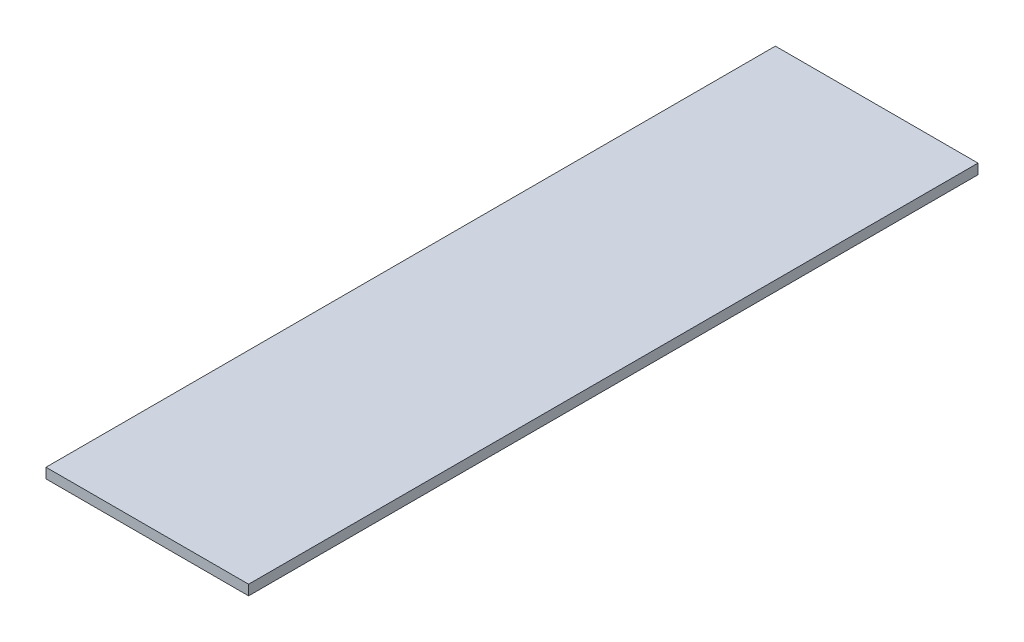
ISO-10303-21;
HEADER;
FILE_DESCRIPTION(('STEP AP214'),'2;1');
FILE_NAME('part.step','',(''),(''),'','','');
FILE_SCHEMA(('AUTOMOTIVE_DESIGN { 1 0 10303 214 1 1 1 1 }'));
ENDSEC;
DATA;
#1=APPLICATION_CONTEXT('core data for automotive mechanical design processes');
#2=APPLICATION_PROTOCOL_DEFINITION('international standard','automotive_design',2000,#1);
#3=PRODUCT_CONTEXT('',#1,'mechanical');
#4=PRODUCT('Part','Part','',(#3));
#5=PRODUCT_RELATED_PRODUCT_CATEGORY('part','',(#4));
#6=PRODUCT_DEFINITION_FORMATION('','',#4);
#7=PRODUCT_DEFINITION_CONTEXT('part definition',#1,'design');
#8=PRODUCT_DEFINITION('design','',#6,#7);
#9=PRODUCT_DEFINITION_SHAPE('','',#8);
#10=(LENGTH_UNIT() NAMED_UNIT(*) SI_UNIT(.MILLI.,.METRE.));
#11=(NAMED_UNIT(*) PLANE_ANGLE_UNIT() SI_UNIT($,.RADIAN.));
#12=(NAMED_UNIT(*) SI_UNIT($,.STERADIAN.) SOLID_ANGLE_UNIT());
#13=UNCERTAINTY_MEASURE_WITH_UNIT(LENGTH_MEASURE(1.E-05),#10,'distance_accuracy_value','');
#14=(GEOMETRIC_REPRESENTATION_CONTEXT(3) GLOBAL_UNCERTAINTY_ASSIGNED_CONTEXT((#13)) GLOBAL_UNIT_ASSIGNED_CONTEXT((#10,
#11,#12)) REPRESENTATION_CONTEXT('',''));
#15=CARTESIAN_POINT('',(0.,0.,0.));
#16=DIRECTION('',(0.,0.,1.));
#17=DIRECTION('',(1.,0.,0.));
#18=AXIS2_PLACEMENT_3D('',#15,#16,#17);
#19=CARTESIAN_POINT('',(0.,6.35,0.));
#20=DIRECTION('',(1.,0.,0.));
#21=DIRECTION('',(0.,0.,-1.));
#22=AXIS2_PLACEMENT_3D('',#19,#20,#21);
#23=PLANE('',#22);
#24=DIRECTION('',(0.,0.,1.));
#25=VECTOR('',#24,1.);
#26=CARTESIAN_POINT('',(0.,0.,0.));
#27=LINE('',#26,#25);
#28=CARTESIAN_POINT('',(0.,0.,-457.2));
#29=VERTEX_POINT('',#28);
#30=CARTESIAN_POINT('',(0.,0.,0.));
#31=VERTEX_POINT('',#30);
#32=EDGE_CURVE('E96',#29,#31,#27,.T.);
#33=ORIENTED_EDGE('',*,*,#32,.T.);
#34=DIRECTION('',(0.,-1.,0.));
#35=VECTOR('',#34,1.);
#36=CARTESIAN_POINT('',(0.,6.35,0.));
#37=LINE('',#36,#35);
#38=CARTESIAN_POINT('',(0.,6.35,0.));
#39=VERTEX_POINT('',#38);
#40=EDGE_CURVE('E11',#39,#31,#37,.T.);
#41=ORIENTED_EDGE('',*,*,#40,.F.);
#42=DIRECTION('',(0.,0.,1.));
#43=VECTOR('',#42,1.);
#44=CARTESIAN_POINT('',(0.,6.35,0.));
#45=LINE('',#44,#43);
#46=CARTESIAN_POINT('',(0.,6.35,-457.2));
#47=VERTEX_POINT('',#46);
#48=EDGE_CURVE('E84',#47,#39,#45,.T.);
#49=ORIENTED_EDGE('',*,*,#48,.F.);
#50=DIRECTION('',(0.,-1.,0.));
#51=VECTOR('',#50,1.);
#52=CARTESIAN_POINT('',(0.,6.35,-457.2));
#53=LINE('',#52,#51);
#54=EDGE_CURVE('E92',#47,#29,#53,.T.);
#55=ORIENTED_EDGE('',*,*,#54,.T.);
#56=EDGE_LOOP('',(#33,#41,#49,#55));
#57=FACE_BOUND('',#56,.T.);
#58=ADVANCED_FACE('F33',(#57),#23,.F.);
#59=CARTESIAN_POINT('',(0.,6.35,0.));
#60=DIRECTION('',(0.,0.,-1.));
#61=DIRECTION('',(-1.,0.,0.));
#62=AXIS2_PLACEMENT_3D('',#59,#60,#61);
#63=PLANE('',#62);
#64=DIRECTION('',(1.,0.,0.));
#65=VECTOR('',#64,1.);
#66=CARTESIAN_POINT('',(0.,0.,0.));
#67=LINE('',#66,#65);
#68=CARTESIAN_POINT('',(127.,0.,0.));
#69=VERTEX_POINT('',#68);
#70=EDGE_CURVE('E88',#31,#69,#67,.T.);
#71=ORIENTED_EDGE('',*,*,#70,.T.);
#72=DIRECTION('',(0.,-1.,0.));
#73=VECTOR('',#72,1.);
#74=CARTESIAN_POINT('',(127.,6.35,0.));
#75=LINE('',#74,#73);
#76=CARTESIAN_POINT('',(127.,6.35,0.));
#77=VERTEX_POINT('',#76);
#78=EDGE_CURVE('E41',#77,#69,#75,.T.);
#79=ORIENTED_EDGE('',*,*,#78,.F.);
#80=DIRECTION('',(1.,0.,0.));
#81=VECTOR('',#80,1.);
#82=CARTESIAN_POINT('',(0.,6.35,0.));
#83=LINE('',#82,#81);
#84=EDGE_CURVE('E79',#39,#77,#83,.T.);
#85=ORIENTED_EDGE('',*,*,#84,.F.);
#86=ORIENTED_EDGE('',*,*,#40,.T.);
#87=EDGE_LOOP('',(#71,#79,#85,#86));
#88=FACE_BOUND('',#87,.T.);
#89=ADVANCED_FACE('F87',(#88),#63,.F.);
#90=CARTESIAN_POINT('',(127.,6.35,0.));
#91=DIRECTION('',(-1.,0.,0.));
#92=DIRECTION('',(0.,0.,1.));
#93=AXIS2_PLACEMENT_3D('',#90,#91,#92);
#94=PLANE('',#93);
#95=DIRECTION('',(0.,0.,-1.));
#96=VECTOR('',#95,1.);
#97=CARTESIAN_POINT('',(127.,0.,0.));
#98=LINE('',#97,#96);
#99=CARTESIAN_POINT('',(127.,0.,-457.2));
#100=VERTEX_POINT('',#99);
#101=EDGE_CURVE('E66',#69,#100,#98,.T.);
#102=ORIENTED_EDGE('',*,*,#101,.T.);
#103=DIRECTION('',(0.,-1.,0.));
#104=VECTOR('',#103,1.);
#105=CARTESIAN_POINT('',(127.,6.35,-457.2));
#106=LINE('',#105,#104);
#107=CARTESIAN_POINT('',(127.,6.35,-457.2));
#108=VERTEX_POINT('',#107);
#109=EDGE_CURVE('E89',#108,#100,#106,.T.);
#110=ORIENTED_EDGE('',*,*,#109,.F.);
#111=DIRECTION('',(0.,0.,-1.));
#112=VECTOR('',#111,1.);
#113=CARTESIAN_POINT('',(127.,6.35,0.));
#114=LINE('',#113,#112);
#115=EDGE_CURVE('E82',#77,#108,#114,.T.);
#116=ORIENTED_EDGE('',*,*,#115,.F.);
#117=ORIENTED_EDGE('',*,*,#78,.T.);
#118=EDGE_LOOP('',(#102,#110,#116,#117));
#119=FACE_BOUND('',#118,.T.);
#120=ADVANCED_FACE('F90',(#119),#94,.F.);
#121=CARTESIAN_POINT('',(0.,6.35,-457.2));
#122=DIRECTION('',(0.,0.,1.));
#123=DIRECTION('',(1.,0.,0.));
#124=AXIS2_PLACEMENT_3D('',#121,#122,#123);
#125=PLANE('',#124);
#126=DIRECTION('',(-1.,0.,0.));
#127=VECTOR('',#126,1.);
#128=CARTESIAN_POINT('',(0.,0.,-457.2));
#129=LINE('',#128,#127);
#130=EDGE_CURVE('E72',#100,#29,#129,.T.);
#131=ORIENTED_EDGE('',*,*,#130,.T.);
#132=ORIENTED_EDGE('',*,*,#54,.F.);
#133=DIRECTION('',(-1.,0.,0.));
#134=VECTOR('',#133,1.);
#135=CARTESIAN_POINT('',(0.,6.35,-457.2));
#136=LINE('',#135,#134);
#137=EDGE_CURVE('E49',#108,#47,#136,.T.);
#138=ORIENTED_EDGE('',*,*,#137,.F.);
#139=ORIENTED_EDGE('',*,*,#109,.T.);
#140=EDGE_LOOP('',(#131,#132,#138,#139));
#141=FACE_BOUND('',#140,.T.);
#142=ADVANCED_FACE('F103',(#141),#125,.F.);
#143=CARTESIAN_POINT('',(0.,6.35,0.));
#144=DIRECTION('',(0.,-1.,0.));
#145=DIRECTION('',(0.,0.,-1.));
#146=AXIS2_PLACEMENT_3D('',#143,#144,#145);
#147=PLANE('',#146);
#148=ORIENTED_EDGE('',*,*,#48,.T.);
#149=ORIENTED_EDGE('',*,*,#84,.T.);
#150=ORIENTED_EDGE('',*,*,#115,.T.);
#151=ORIENTED_EDGE('',*,*,#137,.T.);
#152=EDGE_LOOP('',(#148,#149,#150,#151));
#153=FACE_BOUND('',#152,.T.);
#154=ADVANCED_FACE('F80',(#153),#147,.F.);
#155=CARTESIAN_POINT('',(0.,0.,0.));
#156=DIRECTION('',(0.,-1.,0.));
#157=DIRECTION('',(0.,0.,-1.));
#158=AXIS2_PLACEMENT_3D('',#155,#156,#157);
#159=PLANE('',#158);
#160=ORIENTED_EDGE('',*,*,#32,.F.);
#161=ORIENTED_EDGE('',*,*,#130,.F.);
#162=ORIENTED_EDGE('',*,*,#101,.F.);
#163=ORIENTED_EDGE('',*,*,#70,.F.);
#164=EDGE_LOOP('',(#160,#161,#162,#163));
#165=FACE_BOUND('',#164,.T.);
#166=ADVANCED_FACE('F106',(#165),#159,.T.);
#167=CLOSED_SHELL('',(#58,#89,#120,#142,#154,#166));
#168=MANIFOLD_SOLID_BREP('B2',#167);
#169=ADVANCED_BREP_SHAPE_REPRESENTATION('',(#18,#168),#14);
#170=SHAPE_DEFINITION_REPRESENTATION(#9,#169);
ENDSEC;
END-ISO-10303-21;
